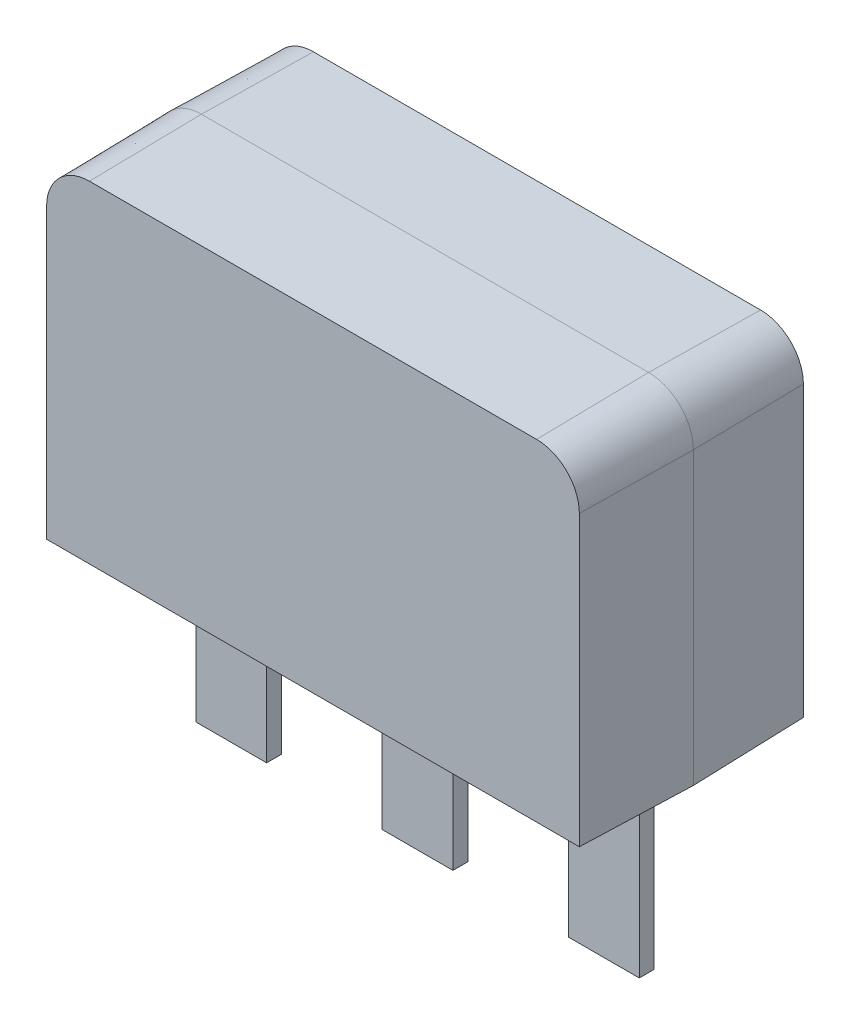
ISO-10303-21;
HEADER;
FILE_DESCRIPTION(('STEP AP214'),'2;1');
FILE_NAME('part.step','',(''),(''),'','','');
FILE_SCHEMA(('AUTOMOTIVE_DESIGN { 1 0 10303 214 1 1 1 1 }'));
ENDSEC;
DATA;
#1=APPLICATION_CONTEXT('core data for automotive mechanical design processes');
#2=APPLICATION_PROTOCOL_DEFINITION('international standard','automotive_design',2000,#1);
#3=PRODUCT_CONTEXT('',#1,'mechanical');
#4=PRODUCT('Part','Part','',(#3));
#5=PRODUCT_RELATED_PRODUCT_CATEGORY('part','',(#4));
#6=PRODUCT_DEFINITION_FORMATION('','',#4);
#7=PRODUCT_DEFINITION_CONTEXT('part definition',#1,'design');
#8=PRODUCT_DEFINITION('design','',#6,#7);
#9=PRODUCT_DEFINITION_SHAPE('','',#8);
#10=(LENGTH_UNIT() NAMED_UNIT(*) SI_UNIT(.MILLI.,.METRE.));
#11=(NAMED_UNIT(*) PLANE_ANGLE_UNIT() SI_UNIT($,.RADIAN.));
#12=(NAMED_UNIT(*) SI_UNIT($,.STERADIAN.) SOLID_ANGLE_UNIT());
#13=UNCERTAINTY_MEASURE_WITH_UNIT(LENGTH_MEASURE(1.E-05),#10,'distance_accuracy_value','');
#14=(GEOMETRIC_REPRESENTATION_CONTEXT(3) GLOBAL_UNCERTAINTY_ASSIGNED_CONTEXT((#13)) GLOBAL_UNIT_ASSIGNED_CONTEXT((#10,
#11,#12)) REPRESENTATION_CONTEXT('',''));
#15=CARTESIAN_POINT('',(0.,0.,0.));
#16=DIRECTION('',(0.,0.,1.));
#17=DIRECTION('',(1.,0.,0.));
#18=AXIS2_PLACEMENT_3D('',#15,#16,#17);
#19=CARTESIAN_POINT('',(3600.,0.,0.));
#20=DIRECTION('',(0.999847695156391,0.,-0.0174524064372835));
#21=DIRECTION('',(-0.0174524064372835,0.,-0.999847695156391));
#22=AXIS2_PLACEMENT_3D('',#19,#20,#21);
#23=PLANE('',#22);
#24=DIRECTION('',(0.,1.,0.));
#25=VECTOR('',#24,1.);
#26=CARTESIAN_POINT('',(3600.,0.,0.));
#27=LINE('',#26,#25);
#28=CARTESIAN_POINT('',(3600.,0.,0.));
#29=VERTEX_POINT('',#28);
#30=CARTESIAN_POINT('',(3600.,3899.99999999999,0.));
#31=VERTEX_POINT('',#30);
#32=EDGE_CURVE('E135',#29,#31,#27,.T.);
#33=ORIENTED_EDGE('',*,*,#32,.F.);
#34=DIRECTION('',(0.0174497491606827,-0.0174497491606827,0.999695459881887));
#35=VECTOR('',#34,1.);
#36=CARTESIAN_POINT('',(3600.,0.,0.));
#37=LINE('',#36,#35);
#38=CARTESIAN_POINT('',(3573.76503741289,26.2349625871111,-1503.));
#39=VERTEX_POINT('',#38);
#40=EDGE_CURVE('E12',#39,#29,#37,.T.);
#41=ORIENTED_EDGE('',*,*,#40,.F.);
#42=DIRECTION('',(0.,1.,0.));
#43=VECTOR('',#42,1.);
#44=CARTESIAN_POINT('',(3573.76503741289,0.,-1503.));
#45=LINE('',#44,#43);
#46=CARTESIAN_POINT('',(3573.76503741289,3899.99999999999,-1503.));
#47=VERTEX_POINT('',#46);
#48=EDGE_CURVE('E160',#39,#47,#45,.T.);
#49=ORIENTED_EDGE('',*,*,#48,.T.);
#50=DIRECTION('',(0.0174524064372835,0.,0.999847695156391));
#51=VECTOR('',#50,1.);
#52=CARTESIAN_POINT('',(3600.,3899.99999999999,0.));
#53=LINE('',#52,#51);
#54=EDGE_CURVE('E94',#47,#31,#53,.T.);
#55=ORIENTED_EDGE('',*,*,#54,.T.);
#56=EDGE_LOOP('',(#33,#41,#49,#55));
#57=FACE_BOUND('',#56,.T.);
#58=ADVANCED_FACE('F50',(#57),#23,.T.);
#59=CARTESIAN_POINT('',(3600.,0.,0.));
#60=DIRECTION('',(0.,-0.999847695156391,-0.0174524064372835));
#61=DIRECTION('',(0.,0.0174524064372835,-0.999847695156391));
#62=AXIS2_PLACEMENT_3D('',#59,#60,#61);
#63=PLANE('',#62);
#64=DIRECTION('',(1.,0.,0.));
#65=VECTOR('',#64,1.);
#66=CARTESIAN_POINT('',(3600.,0.,0.));
#67=LINE('',#66,#65);
#68=CARTESIAN_POINT('',(-3600.,-8.81745695386094E-13,0.));
#69=VERTEX_POINT('',#68);
#70=EDGE_CURVE('E146',#69,#29,#67,.T.);
#71=ORIENTED_EDGE('',*,*,#70,.F.);
#72=DIRECTION('',(-0.0174497491606827,-0.0174497491606827,0.999695459881887));
#73=VECTOR('',#72,1.);
#74=CARTESIAN_POINT('',(-3600.,-8.81745695386094E-13,0.));
#75=LINE('',#74,#73);
#76=CARTESIAN_POINT('',(-3573.76503741289,26.2349625871102,-1503.));
#77=VERTEX_POINT('',#76);
#78=EDGE_CURVE('E61',#77,#69,#75,.T.);
#79=ORIENTED_EDGE('',*,*,#78,.F.);
#80=DIRECTION('',(1.,0.,0.));
#81=VECTOR('',#80,1.);
#82=CARTESIAN_POINT('',(3600.,26.2349625871111,-1503.));
#83=LINE('',#82,#81);
#84=EDGE_CURVE('E149',#77,#39,#83,.T.);
#85=ORIENTED_EDGE('',*,*,#84,.T.);
#86=ORIENTED_EDGE('',*,*,#40,.T.);
#87=EDGE_LOOP('',(#71,#79,#85,#86));
#88=FACE_BOUND('',#87,.T.);
#89=ADVANCED_FACE('F52',(#88),#63,.T.);
#90=CARTESIAN_POINT('',(-3600.,-8.81745695386094E-13,0.));
#91=DIRECTION('',(-0.999847695156391,0.,-0.0174524064372835));
#92=DIRECTION('',(-0.0174524064372835,0.,0.999847695156391));
#93=AXIS2_PLACEMENT_3D('',#90,#91,#92);
#94=PLANE('',#93);
#95=DIRECTION('',(0.,-1.,0.));
#96=VECTOR('',#95,1.);
#97=CARTESIAN_POINT('',(-3600.,-8.81745695386094E-13,0.));
#98=LINE('',#97,#96);
#99=CARTESIAN_POINT('',(-3600.,3899.99999999999,0.));
#100=VERTEX_POINT('',#99);
#101=EDGE_CURVE('E161',#100,#69,#98,.T.);
#102=ORIENTED_EDGE('',*,*,#101,.F.);
#103=DIRECTION('',(-0.0174524064372835,0.,0.999847695156391));
#104=VECTOR('',#103,1.);
#105=CARTESIAN_POINT('',(-3600.,3899.99999999999,0.));
#106=LINE('',#105,#104);
#107=CARTESIAN_POINT('',(-3573.76503741289,3899.99999999999,-1503.));
#108=VERTEX_POINT('',#107);
#109=EDGE_CURVE('E107',#108,#100,#106,.T.);
#110=ORIENTED_EDGE('',*,*,#109,.F.);
#111=DIRECTION('',(0.,-1.,0.));
#112=VECTOR('',#111,1.);
#113=CARTESIAN_POINT('',(-3573.76503741289,-8.81745695386094E-13,-1503.));
#114=LINE('',#113,#112);
#115=EDGE_CURVE('E229',#108,#77,#114,.T.);
#116=ORIENTED_EDGE('',*,*,#115,.T.);
#117=ORIENTED_EDGE('',*,*,#78,.T.);
#118=EDGE_LOOP('',(#102,#110,#116,#117));
#119=FACE_BOUND('',#118,.T.);
#120=ADVANCED_FACE('F260',(#119),#94,.T.);
#121=CARTESIAN_POINT('',(-3000.,3900.,0.));
#122=DIRECTION('',(0.,0.,1.));
#123=DIRECTION('',(-1.,0.,0.));
#124=AXIS2_PLACEMENT_3D('',#121,#122,#123);
#125=CONICAL_SURFACE('',#124,600.,0.0174532925199433);
#126=CARTESIAN_POINT('',(-3000.,3900.,0.));
#127=DIRECTION('',(0.,0.,1.));
#128=DIRECTION('',(-1.,0.,0.));
#129=AXIS2_PLACEMENT_3D('',#126,#127,#128);
#130=CIRCLE('',#129,600.);
#131=CARTESIAN_POINT('',(-2999.99999999999,4500.,0.));
#132=VERTEX_POINT('',#131);
#133=EDGE_CURVE('E208',#132,#100,#130,.T.);
#134=ORIENTED_EDGE('',*,*,#133,.F.);
#135=DIRECTION('',(0.,0.0174524064372835,0.999847695156391));
#136=VECTOR('',#135,1.);
#137=CARTESIAN_POINT('',(-2999.99999999999,4500.,0.));
#138=LINE('',#137,#136);
#139=CARTESIAN_POINT('',(-2999.99999999999,4473.76503741289,-1503.));
#140=VERTEX_POINT('',#139);
#141=EDGE_CURVE('E218',#140,#132,#138,.T.);
#142=ORIENTED_EDGE('',*,*,#141,.F.);
#143=CARTESIAN_POINT('',(-3000.,3900.,-1503.));
#144=DIRECTION('',(0.,0.,-1.));
#145=DIRECTION('',(-1.,0.,0.));
#146=AXIS2_PLACEMENT_3D('',#143,#144,#145);
#147=CIRCLE('',#146,573.765037412889);
#148=EDGE_CURVE('E232',#140,#108,#147,.F.);
#149=ORIENTED_EDGE('',*,*,#148,.T.);
#150=ORIENTED_EDGE('',*,*,#109,.T.);
#151=EDGE_LOOP('',(#134,#142,#149,#150));
#152=FACE_BOUND('',#151,.T.);
#153=ADVANCED_FACE('F242',(#152),#125,.T.);
#154=CARTESIAN_POINT('',(-2999.99999999999,4500.,0.));
#155=DIRECTION('',(0.,0.999847695156391,-0.0174524064372835));
#156=DIRECTION('',(0.,0.0174524064372835,0.999847695156391));
#157=AXIS2_PLACEMENT_3D('',#154,#155,#156);
#158=PLANE('',#157);
#159=DIRECTION('',(-1.,0.,0.));
#160=VECTOR('',#159,1.);
#161=CARTESIAN_POINT('',(-2999.99999999999,4500.,0.));
#162=LINE('',#161,#160);
#163=CARTESIAN_POINT('',(3000.,4500.,0.));
#164=VERTEX_POINT('',#163);
#165=EDGE_CURVE('E204',#164,#132,#162,.T.);
#166=ORIENTED_EDGE('',*,*,#165,.F.);
#167=DIRECTION('',(0.,0.0174524064372835,0.999847695156391));
#168=VECTOR('',#167,1.);
#169=CARTESIAN_POINT('',(3000.,4500.,0.));
#170=LINE('',#169,#168);
#171=CARTESIAN_POINT('',(3000.,4473.76503741289,-1503.));
#172=VERTEX_POINT('',#171);
#173=EDGE_CURVE('E87',#172,#164,#170,.T.);
#174=ORIENTED_EDGE('',*,*,#173,.F.);
#175=DIRECTION('',(-1.,0.,0.));
#176=VECTOR('',#175,1.);
#177=CARTESIAN_POINT('',(-2999.99999999999,4473.76503741289,-1503.));
#178=LINE('',#177,#176);
#179=EDGE_CURVE('E234',#172,#140,#178,.T.);
#180=ORIENTED_EDGE('',*,*,#179,.T.);
#181=ORIENTED_EDGE('',*,*,#141,.T.);
#182=EDGE_LOOP('',(#166,#174,#180,#181));
#183=FACE_BOUND('',#182,.T.);
#184=ADVANCED_FACE('F243',(#183),#158,.T.);
#185=CARTESIAN_POINT('',(3000.,3900.,0.));
#186=DIRECTION('',(0.,0.,1.));
#187=DIRECTION('',(-1.,0.,0.));
#188=AXIS2_PLACEMENT_3D('',#185,#186,#187);
#189=CONICAL_SURFACE('',#188,600.,0.0174532925199433);
#190=CARTESIAN_POINT('',(3000.,3900.,0.));
#191=DIRECTION('',(0.,0.,1.));
#192=DIRECTION('',(-1.,0.,0.));
#193=AXIS2_PLACEMENT_3D('',#190,#191,#192);
#194=CIRCLE('',#193,600.);
#195=EDGE_CURVE('E140',#31,#164,#194,.T.);
#196=ORIENTED_EDGE('',*,*,#195,.F.);
#197=ORIENTED_EDGE('',*,*,#54,.F.);
#198=CARTESIAN_POINT('',(3000.,3900.,-1503.));
#199=DIRECTION('',(0.,0.,-1.));
#200=DIRECTION('',(-1.,0.,0.));
#201=AXIS2_PLACEMENT_3D('',#198,#199,#200);
#202=CIRCLE('',#201,573.765037412889);
#203=EDGE_CURVE('E54',#47,#172,#202,.F.);
#204=ORIENTED_EDGE('',*,*,#203,.T.);
#205=ORIENTED_EDGE('',*,*,#173,.T.);
#206=EDGE_LOOP('',(#196,#197,#204,#205));
#207=FACE_BOUND('',#206,.T.);
#208=ADVANCED_FACE('F237',(#207),#189,.T.);
#209=CARTESIAN_POINT('',(3000.,3900.,-1503.));
#210=DIRECTION('',(0.,0.,-1.));
#211=DIRECTION('',(-1.,0.,0.));
#212=AXIS2_PLACEMENT_3D('',#209,#210,#211);
#213=PLANE('',#212);
#214=ORIENTED_EDGE('',*,*,#48,.F.);
#215=ORIENTED_EDGE('',*,*,#84,.F.);
#216=ORIENTED_EDGE('',*,*,#115,.F.);
#217=ORIENTED_EDGE('',*,*,#148,.F.);
#218=ORIENTED_EDGE('',*,*,#179,.F.);
#219=ORIENTED_EDGE('',*,*,#203,.F.);
#220=EDGE_LOOP('',(#214,#215,#216,#217,#218,#219));
#221=FACE_BOUND('',#220,.T.);
#222=ADVANCED_FACE('F239',(#221),#213,.T.);
#223=CARTESIAN_POINT('',(3600.,0.,0.));
#224=DIRECTION('',(0.999847695156391,0.,0.0174524064372835));
#225=DIRECTION('',(0.0174524064372835,0.,-0.999847695156391));
#226=AXIS2_PLACEMENT_3D('',#223,#224,#225);
#227=PLANE('',#226);
#228=ORIENTED_EDGE('',*,*,#32,.T.);
#229=DIRECTION('',(0.0174524064372835,0.,-0.999847695156391));
#230=VECTOR('',#229,1.);
#231=CARTESIAN_POINT('',(3600.,3899.99999999999,0.));
#232=LINE('',#231,#230);
#233=CARTESIAN_POINT('',(3573.76503741289,3899.99999999999,1503.));
#234=VERTEX_POINT('',#233);
#235=EDGE_CURVE('E141',#234,#31,#232,.T.);
#236=ORIENTED_EDGE('',*,*,#235,.F.);
#237=DIRECTION('',(0.,-1.,0.));
#238=VECTOR('',#237,1.);
#239=CARTESIAN_POINT('',(3573.76503741289,3900.,1503.));
#240=LINE('',#239,#238);
#241=CARTESIAN_POINT('',(3573.76503741289,26.2349625871111,1503.));
#242=VERTEX_POINT('',#241);
#243=EDGE_CURVE('E165',#242,#234,#240,.F.);
#244=ORIENTED_EDGE('',*,*,#243,.F.);
#245=DIRECTION('',(0.0174497491606827,-0.0174497491606827,-0.999695459881887));
#246=VECTOR('',#245,1.);
#247=CARTESIAN_POINT('',(3600.,0.,0.));
#248=LINE('',#247,#246);
#249=EDGE_CURVE('E155',#242,#29,#248,.T.);
#250=ORIENTED_EDGE('',*,*,#249,.T.);
#251=EDGE_LOOP('',(#228,#236,#244,#250));
#252=FACE_BOUND('',#251,.T.);
#253=ADVANCED_FACE('F163',(#252),#227,.T.);
#254=CARTESIAN_POINT('',(3000.,3900.,0.));
#255=DIRECTION('',(0.,0.,-1.));
#256=DIRECTION('',(-1.,0.,0.));
#257=AXIS2_PLACEMENT_3D('',#254,#255,#256);
#258=CONICAL_SURFACE('',#257,600.,0.0174532925199433);
#259=ORIENTED_EDGE('',*,*,#195,.T.);
#260=DIRECTION('',(0.,0.0174524064372835,-0.999847695156391));
#261=VECTOR('',#260,1.);
#262=CARTESIAN_POINT('',(3000.,4500.,0.));
#263=LINE('',#262,#261);
#264=CARTESIAN_POINT('',(3000.,4473.76503741289,1503.));
#265=VERTEX_POINT('',#264);
#266=EDGE_CURVE('E184',#265,#164,#263,.T.);
#267=ORIENTED_EDGE('',*,*,#266,.F.);
#268=CARTESIAN_POINT('',(3000.,3900.,1503.));
#269=DIRECTION('',(0.,0.,-1.));
#270=DIRECTION('',(-1.,0.,0.));
#271=AXIS2_PLACEMENT_3D('',#268,#269,#270);
#272=CIRCLE('',#271,573.765037412889);
#273=EDGE_CURVE('E190',#234,#265,#272,.F.);
#274=ORIENTED_EDGE('',*,*,#273,.F.);
#275=ORIENTED_EDGE('',*,*,#235,.T.);
#276=EDGE_LOOP('',(#259,#267,#274,#275));
#277=FACE_BOUND('',#276,.T.);
#278=ADVANCED_FACE('F249',(#277),#258,.T.);
#279=CARTESIAN_POINT('',(-2999.99999999999,4500.,0.));
#280=DIRECTION('',(0.,0.999847695156391,0.0174524064372835));
#281=DIRECTION('',(0.,-0.0174524064372835,0.999847695156391));
#282=AXIS2_PLACEMENT_3D('',#279,#280,#281);
#283=PLANE('',#282);
#284=ORIENTED_EDGE('',*,*,#165,.T.);
#285=DIRECTION('',(0.,0.0174524064372835,-0.999847695156391));
#286=VECTOR('',#285,1.);
#287=CARTESIAN_POINT('',(-2999.99999999999,4500.,0.));
#288=LINE('',#287,#286);
#289=CARTESIAN_POINT('',(-2999.99999999999,4473.76503741289,1503.));
#290=VERTEX_POINT('',#289);
#291=EDGE_CURVE('E180',#290,#132,#288,.T.);
#292=ORIENTED_EDGE('',*,*,#291,.F.);
#293=DIRECTION('',(1.,0.,0.));
#294=VECTOR('',#293,1.);
#295=CARTESIAN_POINT('',(3000.,4473.76503741289,1503.));
#296=LINE('',#295,#294);
#297=EDGE_CURVE('E193',#265,#290,#296,.F.);
#298=ORIENTED_EDGE('',*,*,#297,.F.);
#299=ORIENTED_EDGE('',*,*,#266,.T.);
#300=EDGE_LOOP('',(#284,#292,#298,#299));
#301=FACE_BOUND('',#300,.T.);
#302=ADVANCED_FACE('F251',(#301),#283,.T.);
#303=CARTESIAN_POINT('',(-3000.,3900.,0.));
#304=DIRECTION('',(0.,0.,-1.));
#305=DIRECTION('',(-1.,0.,0.));
#306=AXIS2_PLACEMENT_3D('',#303,#304,#305);
#307=CONICAL_SURFACE('',#306,600.,0.0174532925199433);
#308=ORIENTED_EDGE('',*,*,#133,.T.);
#309=DIRECTION('',(-0.0174524064372835,0.,-0.999847695156391));
#310=VECTOR('',#309,1.);
#311=CARTESIAN_POINT('',(-3600.,3899.99999999999,0.));
#312=LINE('',#311,#310);
#313=CARTESIAN_POINT('',(-3573.76503741289,3899.99999999999,1503.));
#314=VERTEX_POINT('',#313);
#315=EDGE_CURVE('E171',#314,#100,#312,.T.);
#316=ORIENTED_EDGE('',*,*,#315,.F.);
#317=CARTESIAN_POINT('',(-3000.,3900.,1503.));
#318=DIRECTION('',(0.,0.,-1.));
#319=DIRECTION('',(-1.,0.,0.));
#320=AXIS2_PLACEMENT_3D('',#317,#318,#319);
#321=CIRCLE('',#320,573.765037412889);
#322=EDGE_CURVE('E196',#290,#314,#321,.F.);
#323=ORIENTED_EDGE('',*,*,#322,.F.);
#324=ORIENTED_EDGE('',*,*,#291,.T.);
#325=EDGE_LOOP('',(#308,#316,#323,#324));
#326=FACE_BOUND('',#325,.T.);
#327=ADVANCED_FACE('F262',(#326),#307,.T.);
#328=CARTESIAN_POINT('',(-3600.,-8.81745695386094E-13,0.));
#329=DIRECTION('',(-0.999847695156391,0.,0.0174524064372835));
#330=DIRECTION('',(0.0174524064372835,0.,0.999847695156391));
#331=AXIS2_PLACEMENT_3D('',#328,#329,#330);
#332=PLANE('',#331);
#333=ORIENTED_EDGE('',*,*,#101,.T.);
#334=DIRECTION('',(-0.0174497491606827,-0.0174497491606827,-0.999695459881887));
#335=VECTOR('',#334,1.);
#336=CARTESIAN_POINT('',(-3597.80764503045,2.1923549695485,125.599932086489));
#337=LINE('',#336,#335);
#338=CARTESIAN_POINT('',(-3573.76503741289,26.2349625871102,1503.));
#339=VERTEX_POINT('',#338);
#340=EDGE_CURVE('E158',#339,#69,#337,.T.);
#341=ORIENTED_EDGE('',*,*,#340,.F.);
#342=DIRECTION('',(0.,1.,0.));
#343=VECTOR('',#342,1.);
#344=CARTESIAN_POINT('',(-3573.76503741289,3900.,1503.));
#345=LINE('',#344,#343);
#346=EDGE_CURVE('E173',#314,#339,#345,.F.);
#347=ORIENTED_EDGE('',*,*,#346,.F.);
#348=ORIENTED_EDGE('',*,*,#315,.T.);
#349=EDGE_LOOP('',(#333,#341,#347,#348));
#350=FACE_BOUND('',#349,.T.);
#351=ADVANCED_FACE('F259',(#350),#332,.T.);
#352=CARTESIAN_POINT('',(3600.,0.,0.));
#353=DIRECTION('',(0.,-0.999847695156391,0.0174524064372835));
#354=DIRECTION('',(0.,-0.0174524064372835,-0.999847695156391));
#355=AXIS2_PLACEMENT_3D('',#352,#353,#354);
#356=PLANE('',#355);
#357=ORIENTED_EDGE('',*,*,#70,.T.);
#358=ORIENTED_EDGE('',*,*,#249,.F.);
#359=DIRECTION('',(-1.,0.,0.));
#360=VECTOR('',#359,1.);
#361=CARTESIAN_POINT('',(3000.,26.234962587111,1503.));
#362=LINE('',#361,#360);
#363=EDGE_CURVE('E167',#339,#242,#362,.F.);
#364=ORIENTED_EDGE('',*,*,#363,.F.);
#365=ORIENTED_EDGE('',*,*,#340,.T.);
#366=EDGE_LOOP('',(#357,#358,#364,#365));
#367=FACE_BOUND('',#366,.T.);
#368=ADVANCED_FACE('F153',(#367),#356,.T.);
#369=CARTESIAN_POINT('',(3000.,3900.,1503.));
#370=DIRECTION('',(0.,0.,-1.));
#371=DIRECTION('',(-1.,0.,0.));
#372=AXIS2_PLACEMENT_3D('',#369,#370,#371);
#373=PLANE('',#372);
#374=ORIENTED_EDGE('',*,*,#243,.T.);
#375=ORIENTED_EDGE('',*,*,#273,.T.);
#376=ORIENTED_EDGE('',*,*,#297,.T.);
#377=ORIENTED_EDGE('',*,*,#322,.T.);
#378=ORIENTED_EDGE('',*,*,#346,.T.);
#379=ORIENTED_EDGE('',*,*,#363,.T.);
#380=EDGE_LOOP('',(#374,#375,#376,#377,#378,#379));
#381=FACE_BOUND('',#380,.T.);
#382=ADVANCED_FACE('F254',(#381),#373,.F.);
#383=CLOSED_SHELL('',(#58,#89,#120,#153,#184,#208,#222,#253,#278,#302,#327,#351,#368,#382));
#384=MANIFOLD_SOLID_BREP('B2',#383);
#385=CARTESIAN_POINT('',(-475.,-2499.,100.000000000001));
#386=DIRECTION('',(0.,0.,1.));
#387=DIRECTION('',(1.,0.,0.));
#388=AXIS2_PLACEMENT_3D('',#385,#386,#387);
#389=PLANE('',#388);
#390=DIRECTION('',(1.,0.,0.));
#391=VECTOR('',#390,1.);
#392=CARTESIAN_POINT('',(-475.,0.,100.000000000001));
#393=LINE('',#392,#391);
#394=CARTESIAN_POINT('',(-475.,0.,100.000000000001));
#395=VERTEX_POINT('',#394);
#396=CARTESIAN_POINT('',(475.,0.,100.000000000001));
#397=VERTEX_POINT('',#396);
#398=EDGE_CURVE('E452',#395,#397,#393,.T.);
#399=ORIENTED_EDGE('',*,*,#398,.F.);
#400=DIRECTION('',(0.,1.,0.));
#401=VECTOR('',#400,1.);
#402=CARTESIAN_POINT('',(-475.,-2499.,100.000000000001));
#403=LINE('',#402,#401);
#404=CARTESIAN_POINT('',(-475.,-2499.,100.000000000001));
#405=VERTEX_POINT('',#404);
#406=EDGE_CURVE('E48',#405,#395,#403,.T.);
#407=ORIENTED_EDGE('',*,*,#406,.F.);
#408=DIRECTION('',(1.,0.,0.));
#409=VECTOR('',#408,1.);
#410=CARTESIAN_POINT('',(-475.,-2499.,100.000000000001));
#411=LINE('',#410,#409);
#412=CARTESIAN_POINT('',(475.,-2499.,100.000000000001));
#413=VERTEX_POINT('',#412);
#414=EDGE_CURVE('E447',#405,#413,#411,.T.);
#415=ORIENTED_EDGE('',*,*,#414,.T.);
#416=DIRECTION('',(0.,1.,0.));
#417=VECTOR('',#416,1.);
#418=CARTESIAN_POINT('',(475.,-2499.,100.000000000001));
#419=LINE('',#418,#417);
#420=EDGE_CURVE('E389',#413,#397,#419,.T.);
#421=ORIENTED_EDGE('',*,*,#420,.T.);
#422=EDGE_LOOP('',(#399,#407,#415,#421));
#423=FACE_BOUND('',#422,.T.);
#424=ADVANCED_FACE('F386',(#423),#389,.T.);
#425=CARTESIAN_POINT('',(-475.,-2499.,-99.9999999999993));
#426=DIRECTION('',(-1.,0.,0.));
#427=DIRECTION('',(0.,0.,1.));
#428=AXIS2_PLACEMENT_3D('',#425,#426,#427);
#429=PLANE('',#428);
#430=DIRECTION('',(0.,0.,1.));
#431=VECTOR('',#430,1.);
#432=CARTESIAN_POINT('',(-475.,0.,-99.9999999999993));
#433=LINE('',#432,#431);
#434=CARTESIAN_POINT('',(-475.,0.,-99.9999999999993));
#435=VERTEX_POINT('',#434);
#436=EDGE_CURVE('E425',#435,#395,#433,.T.);
#437=ORIENTED_EDGE('',*,*,#436,.F.);
#438=DIRECTION('',(0.,1.,0.));
#439=VECTOR('',#438,1.);
#440=CARTESIAN_POINT('',(-475.,-2499.,-99.9999999999993));
#441=LINE('',#440,#439);
#442=CARTESIAN_POINT('',(-475.,-2499.,-99.9999999999993));
#443=VERTEX_POINT('',#442);
#444=EDGE_CURVE('E395',#443,#435,#441,.T.);
#445=ORIENTED_EDGE('',*,*,#444,.F.);
#446=DIRECTION('',(0.,0.,1.));
#447=VECTOR('',#446,1.);
#448=CARTESIAN_POINT('',(-475.,-2499.,-99.9999999999993));
#449=LINE('',#448,#447);
#450=EDGE_CURVE('E444',#443,#405,#449,.T.);
#451=ORIENTED_EDGE('',*,*,#450,.T.);
#452=ORIENTED_EDGE('',*,*,#406,.T.);
#453=EDGE_LOOP('',(#437,#445,#451,#452));
#454=FACE_BOUND('',#453,.T.);
#455=ADVANCED_FACE('F460',(#454),#429,.T.);
#456=CARTESIAN_POINT('',(475.,-2499.,-99.9999999999993));
#457=DIRECTION('',(0.,0.,-1.));
#458=DIRECTION('',(-1.,0.,0.));
#459=AXIS2_PLACEMENT_3D('',#456,#457,#458);
#460=PLANE('',#459);
#461=DIRECTION('',(-1.,0.,0.));
#462=VECTOR('',#461,1.);
#463=CARTESIAN_POINT('',(475.,0.,-99.9999999999993));
#464=LINE('',#463,#462);
#465=CARTESIAN_POINT('',(475.,0.,-99.9999999999993));
#466=VERTEX_POINT('',#465);
#467=EDGE_CURVE('E439',#466,#435,#464,.T.);
#468=ORIENTED_EDGE('',*,*,#467,.F.);
#469=DIRECTION('',(0.,1.,0.));
#470=VECTOR('',#469,1.);
#471=CARTESIAN_POINT('',(475.,-2499.,-99.9999999999993));
#472=LINE('',#471,#470);
#473=CARTESIAN_POINT('',(475.,-2499.,-99.9999999999993));
#474=VERTEX_POINT('',#473);
#475=EDGE_CURVE('E434',#474,#466,#472,.T.);
#476=ORIENTED_EDGE('',*,*,#475,.F.);
#477=DIRECTION('',(-1.,0.,0.));
#478=VECTOR('',#477,1.);
#479=CARTESIAN_POINT('',(475.,-2499.,-99.9999999999993));
#480=LINE('',#479,#478);
#481=EDGE_CURVE('E437',#474,#443,#480,.T.);
#482=ORIENTED_EDGE('',*,*,#481,.T.);
#483=ORIENTED_EDGE('',*,*,#444,.T.);
#484=EDGE_LOOP('',(#468,#476,#482,#483));
#485=FACE_BOUND('',#484,.T.);
#486=ADVANCED_FACE('F436',(#485),#460,.T.);
#487=CARTESIAN_POINT('',(475.,-2499.,100.000000000001));
#488=DIRECTION('',(1.,0.,0.));
#489=DIRECTION('',(0.,0.,-1.));
#490=AXIS2_PLACEMENT_3D('',#487,#488,#489);
#491=PLANE('',#490);
#492=DIRECTION('',(0.,0.,-1.));
#493=VECTOR('',#492,1.);
#494=CARTESIAN_POINT('',(475.,0.,100.000000000001));
#495=LINE('',#494,#493);
#496=EDGE_CURVE('E454',#397,#466,#495,.T.);
#497=ORIENTED_EDGE('',*,*,#496,.F.);
#498=ORIENTED_EDGE('',*,*,#420,.F.);
#499=DIRECTION('',(0.,0.,-1.));
#500=VECTOR('',#499,1.);
#501=CARTESIAN_POINT('',(475.,-2499.,100.000000000001));
#502=LINE('',#501,#500);
#503=EDGE_CURVE('E442',#413,#474,#502,.T.);
#504=ORIENTED_EDGE('',*,*,#503,.T.);
#505=ORIENTED_EDGE('',*,*,#475,.T.);
#506=EDGE_LOOP('',(#497,#498,#504,#505));
#507=FACE_BOUND('',#506,.T.);
#508=ADVANCED_FACE('F446',(#507),#491,.T.);
#509=CARTESIAN_POINT('',(0.,-2499.,0.));
#510=DIRECTION('',(0.,1.,0.));
#511=DIRECTION('',(0.,0.,1.));
#512=AXIS2_PLACEMENT_3D('',#509,#510,#511);
#513=PLANE('',#512);
#514=ORIENTED_EDGE('',*,*,#414,.F.);
#515=ORIENTED_EDGE('',*,*,#450,.F.);
#516=ORIENTED_EDGE('',*,*,#481,.F.);
#517=ORIENTED_EDGE('',*,*,#503,.F.);
#518=EDGE_LOOP('',(#514,#515,#516,#517));
#519=FACE_BOUND('',#518,.T.);
#520=ADVANCED_FACE('F441',(#519),#513,.F.);
#521=CARTESIAN_POINT('',(0.,0.,0.));
#522=DIRECTION('',(0.,1.,0.));
#523=DIRECTION('',(0.,0.,1.));
#524=AXIS2_PLACEMENT_3D('',#521,#522,#523);
#525=PLANE('',#524);
#526=ORIENTED_EDGE('',*,*,#436,.T.);
#527=ORIENTED_EDGE('',*,*,#398,.T.);
#528=ORIENTED_EDGE('',*,*,#496,.T.);
#529=ORIENTED_EDGE('',*,*,#467,.T.);
#530=EDGE_LOOP('',(#526,#527,#528,#529));
#531=FACE_BOUND('',#530,.T.);
#532=ADVANCED_FACE('F458',(#531),#525,.T.);
#533=CLOSED_SHELL('',(#424,#455,#486,#508,#520,#532));
#534=MANIFOLD_SOLID_BREP('B6',#533);
#535=CARTESIAN_POINT('',(2025.,-2499.,100.000000000001));
#536=DIRECTION('',(0.,0.,1.));
#537=DIRECTION('',(1.,0.,0.));
#538=AXIS2_PLACEMENT_3D('',#535,#536,#537);
#539=PLANE('',#538);
#540=DIRECTION('',(1.,0.,0.));
#541=VECTOR('',#540,1.);
#542=CARTESIAN_POINT('',(2025.,0.,100.000000000001));
#543=LINE('',#542,#541);
#544=CARTESIAN_POINT('',(2025.,0.,100.000000000001));
#545=VERTEX_POINT('',#544);
#546=CARTESIAN_POINT('',(2975.,0.,100.000000000001));
#547=VERTEX_POINT('',#546);
#548=EDGE_CURVE('E579',#545,#547,#543,.T.);
#549=ORIENTED_EDGE('',*,*,#548,.F.);
#550=DIRECTION('',(0.,1.,0.));
#551=VECTOR('',#550,1.);
#552=CARTESIAN_POINT('',(2025.,-2499.,100.000000000001));
#553=LINE('',#552,#551);
#554=CARTESIAN_POINT('',(2025.,-2499.,100.000000000001));
#555=VERTEX_POINT('',#554);
#556=EDGE_CURVE('E384',#555,#545,#553,.T.);
#557=ORIENTED_EDGE('',*,*,#556,.F.);
#558=DIRECTION('',(1.,0.,0.));
#559=VECTOR('',#558,1.);
#560=CARTESIAN_POINT('',(2025.,-2499.,100.000000000001));
#561=LINE('',#560,#559);
#562=CARTESIAN_POINT('',(2975.,-2499.,100.000000000001));
#563=VERTEX_POINT('',#562);
#564=EDGE_CURVE('E574',#555,#563,#561,.T.);
#565=ORIENTED_EDGE('',*,*,#564,.T.);
#566=DIRECTION('',(0.,1.,0.));
#567=VECTOR('',#566,1.);
#568=CARTESIAN_POINT('',(2975.,-2499.,100.000000000001));
#569=LINE('',#568,#567);
#570=EDGE_CURVE('E516',#563,#547,#569,.T.);
#571=ORIENTED_EDGE('',*,*,#570,.T.);
#572=EDGE_LOOP('',(#549,#557,#565,#571));
#573=FACE_BOUND('',#572,.T.);
#574=ADVANCED_FACE('F513',(#573),#539,.T.);
#575=CARTESIAN_POINT('',(2025.,-2499.,-99.9999999999981));
#576=DIRECTION('',(-1.,0.,0.));
#577=DIRECTION('',(0.,0.,1.));
#578=AXIS2_PLACEMENT_3D('',#575,#576,#577);
#579=PLANE('',#578);
#580=DIRECTION('',(0.,0.,1.));
#581=VECTOR('',#580,1.);
#582=CARTESIAN_POINT('',(2025.,0.,-99.9999999999981));
#583=LINE('',#582,#581);
#584=CARTESIAN_POINT('',(2025.,0.,-99.9999999999981));
#585=VERTEX_POINT('',#584);
#586=EDGE_CURVE('E552',#585,#545,#583,.T.);
#587=ORIENTED_EDGE('',*,*,#586,.F.);
#588=DIRECTION('',(0.,1.,0.));
#589=VECTOR('',#588,1.);
#590=CARTESIAN_POINT('',(2025.,-2499.,-99.9999999999981));
#591=LINE('',#590,#589);
#592=CARTESIAN_POINT('',(2025.,-2499.,-99.9999999999981));
#593=VERTEX_POINT('',#592);
#594=EDGE_CURVE('E522',#593,#585,#591,.T.);
#595=ORIENTED_EDGE('',*,*,#594,.F.);
#596=DIRECTION('',(0.,0.,1.));
#597=VECTOR('',#596,1.);
#598=CARTESIAN_POINT('',(2025.,-2499.,-99.9999999999981));
#599=LINE('',#598,#597);
#600=EDGE_CURVE('E571',#593,#555,#599,.T.);
#601=ORIENTED_EDGE('',*,*,#600,.T.);
#602=ORIENTED_EDGE('',*,*,#556,.T.);
#603=EDGE_LOOP('',(#587,#595,#601,#602));
#604=FACE_BOUND('',#603,.T.);
#605=ADVANCED_FACE('F587',(#604),#579,.T.);
#606=CARTESIAN_POINT('',(2975.,-2499.,-99.9999999999981));
#607=DIRECTION('',(0.,0.,-1.));
#608=DIRECTION('',(-1.,0.,0.));
#609=AXIS2_PLACEMENT_3D('',#606,#607,#608);
#610=PLANE('',#609);
#611=DIRECTION('',(-1.,0.,0.));
#612=VECTOR('',#611,1.);
#613=CARTESIAN_POINT('',(2975.,0.,-99.9999999999981));
#614=LINE('',#613,#612);
#615=CARTESIAN_POINT('',(2975.,0.,-99.9999999999981));
#616=VERTEX_POINT('',#615);
#617=EDGE_CURVE('E566',#616,#585,#614,.T.);
#618=ORIENTED_EDGE('',*,*,#617,.F.);
#619=DIRECTION('',(0.,1.,0.));
#620=VECTOR('',#619,1.);
#621=CARTESIAN_POINT('',(2975.,-2499.,-99.9999999999981));
#622=LINE('',#621,#620);
#623=CARTESIAN_POINT('',(2975.,-2499.,-99.9999999999981));
#624=VERTEX_POINT('',#623);
#625=EDGE_CURVE('E561',#624,#616,#622,.T.);
#626=ORIENTED_EDGE('',*,*,#625,.F.);
#627=DIRECTION('',(-1.,0.,0.));
#628=VECTOR('',#627,1.);
#629=CARTESIAN_POINT('',(2975.,-2499.,-99.9999999999981));
#630=LINE('',#629,#628);
#631=EDGE_CURVE('E564',#624,#593,#630,.T.);
#632=ORIENTED_EDGE('',*,*,#631,.T.);
#633=ORIENTED_EDGE('',*,*,#594,.T.);
#634=EDGE_LOOP('',(#618,#626,#632,#633));
#635=FACE_BOUND('',#634,.T.);
#636=ADVANCED_FACE('F563',(#635),#610,.T.);
#637=CARTESIAN_POINT('',(2975.,-2499.,100.000000000001));
#638=DIRECTION('',(1.,0.,0.));
#639=DIRECTION('',(0.,0.,-1.));
#640=AXIS2_PLACEMENT_3D('',#637,#638,#639);
#641=PLANE('',#640);
#642=DIRECTION('',(0.,0.,-1.));
#643=VECTOR('',#642,1.);
#644=CARTESIAN_POINT('',(2975.,0.,100.000000000001));
#645=LINE('',#644,#643);
#646=EDGE_CURVE('E581',#547,#616,#645,.T.);
#647=ORIENTED_EDGE('',*,*,#646,.F.);
#648=ORIENTED_EDGE('',*,*,#570,.F.);
#649=DIRECTION('',(0.,0.,-1.));
#650=VECTOR('',#649,1.);
#651=CARTESIAN_POINT('',(2975.,-2499.,100.000000000001));
#652=LINE('',#651,#650);
#653=EDGE_CURVE('E569',#563,#624,#652,.T.);
#654=ORIENTED_EDGE('',*,*,#653,.T.);
#655=ORIENTED_EDGE('',*,*,#625,.T.);
#656=EDGE_LOOP('',(#647,#648,#654,#655));
#657=FACE_BOUND('',#656,.T.);
#658=ADVANCED_FACE('F573',(#657),#641,.T.);
#659=CARTESIAN_POINT('',(0.,-2499.,0.));
#660=DIRECTION('',(0.,1.,0.));
#661=DIRECTION('',(0.,0.,1.));
#662=AXIS2_PLACEMENT_3D('',#659,#660,#661);
#663=PLANE('',#662);
#664=ORIENTED_EDGE('',*,*,#564,.F.);
#665=ORIENTED_EDGE('',*,*,#600,.F.);
#666=ORIENTED_EDGE('',*,*,#631,.F.);
#667=ORIENTED_EDGE('',*,*,#653,.F.);
#668=EDGE_LOOP('',(#664,#665,#666,#667));
#669=FACE_BOUND('',#668,.T.);
#670=ADVANCED_FACE('F568',(#669),#663,.F.);
#671=CARTESIAN_POINT('',(0.,0.,0.));
#672=DIRECTION('',(0.,1.,0.));
#673=DIRECTION('',(0.,0.,1.));
#674=AXIS2_PLACEMENT_3D('',#671,#672,#673);
#675=PLANE('',#674);
#676=ORIENTED_EDGE('',*,*,#586,.T.);
#677=ORIENTED_EDGE('',*,*,#548,.T.);
#678=ORIENTED_EDGE('',*,*,#646,.T.);
#679=ORIENTED_EDGE('',*,*,#617,.T.);
#680=EDGE_LOOP('',(#676,#677,#678,#679));
#681=FACE_BOUND('',#680,.T.);
#682=ADVANCED_FACE('F585',(#681),#675,.T.);
#683=CLOSED_SHELL('',(#574,#605,#636,#658,#670,#682));
#684=MANIFOLD_SOLID_BREP('B42',#683);
#685=CARTESIAN_POINT('',(-2975.,-2499.,100.000000000001));
#686=DIRECTION('',(-1.,0.,0.));
#687=DIRECTION('',(0.,0.,1.));
#688=AXIS2_PLACEMENT_3D('',#685,#686,#687);
#689=PLANE('',#688);
#690=DIRECTION('',(0.,0.,1.));
#691=VECTOR('',#690,1.);
#692=CARTESIAN_POINT('',(-2975.,0.,100.000000000001));
#693=LINE('',#692,#691);
#694=CARTESIAN_POINT('',(-2975.,0.,-99.9999999999991));
#695=VERTEX_POINT('',#694);
#696=CARTESIAN_POINT('',(-2975.,0.,100.000000000001));
#697=VERTEX_POINT('',#696);
#698=EDGE_CURVE('E698',#695,#697,#693,.T.);
#699=ORIENTED_EDGE('',*,*,#698,.F.);
#700=DIRECTION('',(0.,1.,0.));
#701=VECTOR('',#700,1.);
#702=CARTESIAN_POINT('',(-2975.,-2499.,-99.9999999999991));
#703=LINE('',#702,#701);
#704=CARTESIAN_POINT('',(-2975.,-2499.,-99.9999999999991));
#705=VERTEX_POINT('',#704);
#706=EDGE_CURVE('E511',#705,#695,#703,.T.);
#707=ORIENTED_EDGE('',*,*,#706,.F.);
#708=DIRECTION('',(0.,0.,1.));
#709=VECTOR('',#708,1.);
#710=CARTESIAN_POINT('',(-2975.,-2499.,100.000000000001));
#711=LINE('',#710,#709);
#712=CARTESIAN_POINT('',(-2975.,-2499.,100.000000000001));
#713=VERTEX_POINT('',#712);
#714=EDGE_CURVE('E692',#705,#713,#711,.T.);
#715=ORIENTED_EDGE('',*,*,#714,.T.);
#716=DIRECTION('',(0.,1.,0.));
#717=VECTOR('',#716,1.);
#718=CARTESIAN_POINT('',(-2975.,-2499.,100.000000000001));
#719=LINE('',#718,#717);
#720=EDGE_CURVE('E634',#713,#697,#719,.T.);
#721=ORIENTED_EDGE('',*,*,#720,.T.);
#722=EDGE_LOOP('',(#699,#707,#715,#721));
#723=FACE_BOUND('',#722,.T.);
#724=ADVANCED_FACE('F631',(#723),#689,.T.);
#725=CARTESIAN_POINT('',(-2975.,-2499.,-99.9999999999991));
#726=DIRECTION('',(0.,0.,-1.));
#727=DIRECTION('',(-1.,0.,0.));
#728=AXIS2_PLACEMENT_3D('',#725,#726,#727);
#729=PLANE('',#728);
#730=DIRECTION('',(-1.,0.,0.));
#731=VECTOR('',#730,1.);
#732=CARTESIAN_POINT('',(-2975.,0.,-99.9999999999991));
#733=LINE('',#732,#731);
#734=CARTESIAN_POINT('',(-2025.,0.,-99.9999999999991));
#735=VERTEX_POINT('',#734);
#736=EDGE_CURVE('E694',#735,#695,#733,.T.);
#737=ORIENTED_EDGE('',*,*,#736,.F.);
#738=DIRECTION('',(0.,1.,0.));
#739=VECTOR('',#738,1.);
#740=CARTESIAN_POINT('',(-2025.,-2499.,-99.9999999999991));
#741=LINE('',#740,#739);
#742=CARTESIAN_POINT('',(-2025.,-2499.,-99.9999999999991));
#743=VERTEX_POINT('',#742);
#744=EDGE_CURVE('E640',#743,#735,#741,.T.);
#745=ORIENTED_EDGE('',*,*,#744,.F.);
#746=DIRECTION('',(-1.,0.,0.));
#747=VECTOR('',#746,1.);
#748=CARTESIAN_POINT('',(-2975.,-2499.,-99.9999999999991));
#749=LINE('',#748,#747);
#750=EDGE_CURVE('E689',#743,#705,#749,.T.);
#751=ORIENTED_EDGE('',*,*,#750,.T.);
#752=ORIENTED_EDGE('',*,*,#706,.T.);
#753=EDGE_LOOP('',(#737,#745,#751,#752));
#754=FACE_BOUND('',#753,.T.);
#755=ADVANCED_FACE('F704',(#754),#729,.T.);
#756=CARTESIAN_POINT('',(-2025.,-2499.,-99.9999999999991));
#757=DIRECTION('',(1.,0.,0.));
#758=DIRECTION('',(0.,0.,-1.));
#759=AXIS2_PLACEMENT_3D('',#756,#757,#758);
#760=PLANE('',#759);
#761=DIRECTION('',(0.,0.,-1.));
#762=VECTOR('',#761,1.);
#763=CARTESIAN_POINT('',(-2025.,0.,-99.9999999999991));
#764=LINE('',#763,#762);
#765=CARTESIAN_POINT('',(-2025.,0.,100.000000000001));
#766=VERTEX_POINT('',#765);
#767=EDGE_CURVE('E665',#766,#735,#764,.T.);
#768=ORIENTED_EDGE('',*,*,#767,.F.);
#769=DIRECTION('',(0.,1.,0.));
#770=VECTOR('',#769,1.);
#771=CARTESIAN_POINT('',(-2025.,-2499.,100.000000000001));
#772=LINE('',#771,#770);
#773=CARTESIAN_POINT('',(-2025.,-2499.,100.000000000001));
#774=VERTEX_POINT('',#773);
#775=EDGE_CURVE('E681',#774,#766,#772,.T.);
#776=ORIENTED_EDGE('',*,*,#775,.F.);
#777=DIRECTION('',(0.,0.,-1.));
#778=VECTOR('',#777,1.);
#779=CARTESIAN_POINT('',(-2025.,-2499.,-99.9999999999991));
#780=LINE('',#779,#778);
#781=EDGE_CURVE('E684',#774,#743,#780,.T.);
#782=ORIENTED_EDGE('',*,*,#781,.T.);
#783=ORIENTED_EDGE('',*,*,#744,.T.);
#784=EDGE_LOOP('',(#768,#776,#782,#783));
#785=FACE_BOUND('',#784,.T.);
#786=ADVANCED_FACE('F683',(#785),#760,.T.);
#787=CARTESIAN_POINT('',(-2025.,-2499.,100.000000000001));
#788=DIRECTION('',(0.,0.,1.));
#789=DIRECTION('',(1.,0.,0.));
#790=AXIS2_PLACEMENT_3D('',#787,#788,#789);
#791=PLANE('',#790);
#792=DIRECTION('',(1.,0.,0.));
#793=VECTOR('',#792,1.);
#794=CARTESIAN_POINT('',(-2025.,0.,100.000000000001));
#795=LINE('',#794,#793);
#796=EDGE_CURVE('E700',#697,#766,#795,.T.);
#797=ORIENTED_EDGE('',*,*,#796,.F.);
#798=ORIENTED_EDGE('',*,*,#720,.F.);
#799=DIRECTION('',(1.,0.,0.));
#800=VECTOR('',#799,1.);
#801=CARTESIAN_POINT('',(-2025.,-2499.,100.000000000001));
#802=LINE('',#801,#800);
#803=EDGE_CURVE('E688',#713,#774,#802,.T.);
#804=ORIENTED_EDGE('',*,*,#803,.T.);
#805=ORIENTED_EDGE('',*,*,#775,.T.);
#806=EDGE_LOOP('',(#797,#798,#804,#805));
#807=FACE_BOUND('',#806,.T.);
#808=ADVANCED_FACE('F691',(#807),#791,.T.);
#809=CARTESIAN_POINT('',(0.,-2499.,0.));
#810=DIRECTION('',(0.,-1.,0.));
#811=DIRECTION('',(0.,0.,-1.));
#812=AXIS2_PLACEMENT_3D('',#809,#810,#811);
#813=PLANE('',#812);
#814=ORIENTED_EDGE('',*,*,#714,.F.);
#815=ORIENTED_EDGE('',*,*,#750,.F.);
#816=ORIENTED_EDGE('',*,*,#781,.F.);
#817=ORIENTED_EDGE('',*,*,#803,.F.);
#818=EDGE_LOOP('',(#814,#815,#816,#817));
#819=FACE_BOUND('',#818,.T.);
#820=ADVANCED_FACE('F687',(#819),#813,.T.);
#821=CARTESIAN_POINT('',(0.,0.,0.));
#822=DIRECTION('',(0.,-1.,0.));
#823=DIRECTION('',(0.,0.,-1.));
#824=AXIS2_PLACEMENT_3D('',#821,#822,#823);
#825=PLANE('',#824);
#826=ORIENTED_EDGE('',*,*,#698,.T.);
#827=ORIENTED_EDGE('',*,*,#796,.T.);
#828=ORIENTED_EDGE('',*,*,#767,.T.);
#829=ORIENTED_EDGE('',*,*,#736,.T.);
#830=EDGE_LOOP('',(#826,#827,#828,#829));
#831=FACE_BOUND('',#830,.T.);
#832=ADVANCED_FACE('F705',(#831),#825,.F.);
#833=CLOSED_SHELL('',(#724,#755,#786,#808,#820,#832));
#834=MANIFOLD_SOLID_BREP('B378',#833);
#835=ADVANCED_BREP_SHAPE_REPRESENTATION('',(#18,#384,#534,#684,#834),#14);
#836=SHAPE_DEFINITION_REPRESENTATION(#9,#835);
ENDSEC;
END-ISO-10303-21;
